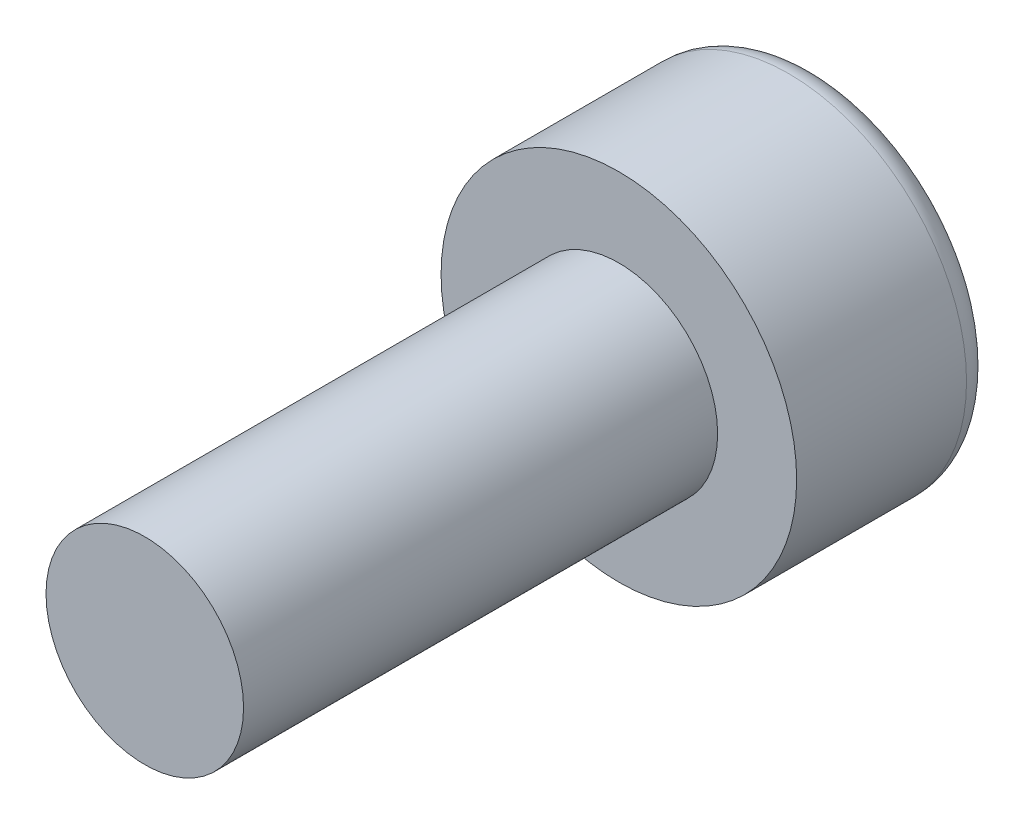
ISO-10303-21;
HEADER;
FILE_DESCRIPTION(('STEP AP214'),'2;1');
FILE_NAME('part.step','',(''),(''),'','','');
FILE_SCHEMA(('AUTOMOTIVE_DESIGN { 1 0 10303 214 1 1 1 1 }'));
ENDSEC;
DATA;
#1=APPLICATION_CONTEXT('core data for automotive mechanical design processes');
#2=APPLICATION_PROTOCOL_DEFINITION('international standard','automotive_design',2000,#1);
#3=PRODUCT_CONTEXT('',#1,'mechanical');
#4=PRODUCT('Part','Part','',(#3));
#5=PRODUCT_RELATED_PRODUCT_CATEGORY('part','',(#4));
#6=PRODUCT_DEFINITION_FORMATION('','',#4);
#7=PRODUCT_DEFINITION_CONTEXT('part definition',#1,'design');
#8=PRODUCT_DEFINITION('design','',#6,#7);
#9=PRODUCT_DEFINITION_SHAPE('','',#8);
#10=(LENGTH_UNIT() NAMED_UNIT(*) SI_UNIT(.MILLI.,.METRE.));
#11=(NAMED_UNIT(*) PLANE_ANGLE_UNIT() SI_UNIT($,.RADIAN.));
#12=(NAMED_UNIT(*) SI_UNIT($,.STERADIAN.) SOLID_ANGLE_UNIT());
#13=UNCERTAINTY_MEASURE_WITH_UNIT(LENGTH_MEASURE(1.E-05),#10,'distance_accuracy_value','');
#14=(GEOMETRIC_REPRESENTATION_CONTEXT(3) GLOBAL_UNCERTAINTY_ASSIGNED_CONTEXT((#13)) GLOBAL_UNIT_ASSIGNED_CONTEXT((#10,
#11,#12)) REPRESENTATION_CONTEXT('',''));
#15=CARTESIAN_POINT('',(0.,0.,0.));
#16=DIRECTION('',(0.,0.,1.));
#17=DIRECTION('',(1.,0.,0.));
#18=AXIS2_PLACEMENT_3D('',#15,#16,#17);
#19=CARTESIAN_POINT('',(0.,0.,6.));
#20=DIRECTION('',(0.,0.,-1.));
#21=DIRECTION('',(-1.,0.,0.));
#22=AXIS2_PLACEMENT_3D('',#19,#20,#21);
#23=CYLINDRICAL_SURFACE('',#22,1.25);
#24=CARTESIAN_POINT('',(0.,0.,6.));
#25=DIRECTION('',(0.,0.,1.));
#26=DIRECTION('',(1.,0.,0.));
#27=AXIS2_PLACEMENT_3D('',#24,#25,#26);
#28=CIRCLE('',#27,1.25);
#29=CARTESIAN_POINT('',(1.25,0.,6.));
#30=VERTEX_POINT('',#29);
#31=EDGE_CURVE('E145',#30,#30,#28,.T.);
#32=ORIENTED_EDGE('',*,*,#31,.F.);
#33=EDGE_LOOP('',(#32));
#34=FACE_BOUND('',#33,.T.);
#35=CARTESIAN_POINT('',(0.,0.,0.));
#36=DIRECTION('',(0.,0.,1.));
#37=DIRECTION('',(1.,0.,0.));
#38=AXIS2_PLACEMENT_3D('',#35,#36,#37);
#39=CIRCLE('',#38,1.25);
#40=CARTESIAN_POINT('',(1.25,0.,0.));
#41=VERTEX_POINT('',#40);
#42=EDGE_CURVE('E144',#41,#41,#39,.T.);
#43=ORIENTED_EDGE('',*,*,#42,.T.);
#44=EDGE_LOOP('',(#43));
#45=FACE_BOUND('',#44,.T.);
#46=ADVANCED_FACE('F34',(#34,#45),#23,.T.);
#47=CARTESIAN_POINT('',(0.,0.,6.));
#48=DIRECTION('',(0.,0.,1.));
#49=DIRECTION('',(1.,0.,0.));
#50=AXIS2_PLACEMENT_3D('',#47,#48,#49);
#51=PLANE('',#50);
#52=ORIENTED_EDGE('',*,*,#31,.T.);
#53=EDGE_LOOP('',(#52));
#54=FACE_BOUND('',#53,.T.);
#55=ADVANCED_FACE('F164',(#54),#51,.T.);
#56=CARTESIAN_POINT('',(0.,0.,-2.5));
#57=DIRECTION('',(0.,0.,1.));
#58=DIRECTION('',(1.,0.,0.));
#59=AXIS2_PLACEMENT_3D('',#56,#57,#58);
#60=CYLINDRICAL_SURFACE('',#59,2.25);
#61=CARTESIAN_POINT('',(0.,0.,-2.15));
#62=DIRECTION('',(0.,0.,-1.));
#63=DIRECTION('',(-1.,0.,0.));
#64=AXIS2_PLACEMENT_3D('',#61,#62,#63);
#65=CIRCLE('',#64,2.25);
#66=CARTESIAN_POINT('',(-2.25,0.,-2.15));
#67=VERTEX_POINT('',#66);
#68=EDGE_CURVE('E11',#67,#67,#65,.F.);
#69=ORIENTED_EDGE('',*,*,#68,.T.);
#70=EDGE_LOOP('',(#69));
#71=FACE_BOUND('',#70,.T.);
#72=CARTESIAN_POINT('',(0.,0.,0.));
#73=DIRECTION('',(0.,0.,-1.));
#74=DIRECTION('',(-1.,0.,0.));
#75=AXIS2_PLACEMENT_3D('',#72,#73,#74);
#76=CIRCLE('',#75,2.25);
#77=CARTESIAN_POINT('',(-2.25,0.,0.));
#78=VERTEX_POINT('',#77);
#79=EDGE_CURVE('E136',#78,#78,#76,.T.);
#80=ORIENTED_EDGE('',*,*,#79,.T.);
#81=EDGE_LOOP('',(#80));
#82=FACE_BOUND('',#81,.T.);
#83=ADVANCED_FACE('F169',(#71,#82),#60,.T.);
#84=CARTESIAN_POINT('',(0.,0.,-2.5));
#85=DIRECTION('',(0.,0.,-1.));
#86=DIRECTION('',(-1.,0.,0.));
#87=AXIS2_PLACEMENT_3D('',#84,#85,#86);
#88=PLANE('',#87);
#89=CARTESIAN_POINT('',(0.,0.,-2.5));
#90=DIRECTION('',(0.,0.,-1.));
#91=DIRECTION('',(-1.,0.,0.));
#92=AXIS2_PLACEMENT_3D('',#89,#90,#91);
#93=CIRCLE('',#92,1.9);
#94=CARTESIAN_POINT('',(-1.9,0.,-2.5));
#95=VERTEX_POINT('',#94);
#96=EDGE_CURVE('E42',#95,#95,#93,.T.);
#97=ORIENTED_EDGE('',*,*,#96,.T.);
#98=EDGE_LOOP('',(#97));
#99=FACE_BOUND('',#98,.T.);
#100=DIRECTION('',(-0.866025403784439,-0.5,0.));
#101=VECTOR('',#100,1.);
#102=CARTESIAN_POINT('',(1.,-0.577350269189626,-2.5));
#103=LINE('',#102,#101);
#104=CARTESIAN_POINT('',(1.,-0.577350269189626,-2.5));
#105=VERTEX_POINT('',#104);
#106=CARTESIAN_POINT('',(0.,-1.15470053837925,-2.5));
#107=VERTEX_POINT('',#106);
#108=EDGE_CURVE('E49',#105,#107,#103,.T.);
#109=ORIENTED_EDGE('',*,*,#108,.F.);
#110=DIRECTION('',(0.,-1.,0.));
#111=VECTOR('',#110,1.);
#112=CARTESIAN_POINT('',(1.,0.577350269189626,-2.5));
#113=LINE('',#112,#111);
#114=CARTESIAN_POINT('',(1.,0.577350269189626,-2.5));
#115=VERTEX_POINT('',#114);
#116=EDGE_CURVE('E132',#115,#105,#113,.T.);
#117=ORIENTED_EDGE('',*,*,#116,.F.);
#118=DIRECTION('',(0.866025403784439,-0.5,0.));
#119=VECTOR('',#118,1.);
#120=CARTESIAN_POINT('',(0.,1.15470053837925,-2.5));
#121=LINE('',#120,#119);
#122=CARTESIAN_POINT('',(0.,1.15470053837925,-2.5));
#123=VERTEX_POINT('',#122);
#124=EDGE_CURVE('E130',#123,#115,#121,.T.);
#125=ORIENTED_EDGE('',*,*,#124,.F.);
#126=DIRECTION('',(0.866025403784439,0.5,0.));
#127=VECTOR('',#126,1.);
#128=CARTESIAN_POINT('',(-1.,0.577350269189626,-2.5));
#129=LINE('',#128,#127);
#130=CARTESIAN_POINT('',(-1.,0.577350269189626,-2.5));
#131=VERTEX_POINT('',#130);
#132=EDGE_CURVE('E97',#131,#123,#129,.T.);
#133=ORIENTED_EDGE('',*,*,#132,.F.);
#134=DIRECTION('',(0.,1.,0.));
#135=VECTOR('',#134,1.);
#136=CARTESIAN_POINT('',(-1.,-0.577350269189626,-2.5));
#137=LINE('',#136,#135);
#138=CARTESIAN_POINT('',(-1.,-0.577350269189626,-2.5));
#139=VERTEX_POINT('',#138);
#140=EDGE_CURVE('E126',#139,#131,#137,.T.);
#141=ORIENTED_EDGE('',*,*,#140,.F.);
#142=DIRECTION('',(-0.866025403784438,0.5,0.));
#143=VECTOR('',#142,1.);
#144=CARTESIAN_POINT('',(0.,-1.15470053837925,-2.5));
#145=LINE('',#144,#143);
#146=EDGE_CURVE('E123',#107,#139,#145,.T.);
#147=ORIENTED_EDGE('',*,*,#146,.F.);
#148=EDGE_LOOP('',(#109,#117,#125,#133,#141,#147));
#149=FACE_BOUND('',#148,.T.);
#150=ADVANCED_FACE('F152',(#99,#149),#88,.T.);
#151=CARTESIAN_POINT('',(0.,0.,0.));
#152=DIRECTION('',(0.,0.,-1.));
#153=DIRECTION('',(-1.,0.,0.));
#154=AXIS2_PLACEMENT_3D('',#151,#152,#153);
#155=PLANE('',#154);
#156=ORIENTED_EDGE('',*,*,#42,.F.);
#157=EDGE_LOOP('',(#156));
#158=FACE_BOUND('',#157,.T.);
#159=ORIENTED_EDGE('',*,*,#79,.F.);
#160=EDGE_LOOP('',(#159));
#161=FACE_BOUND('',#160,.T.);
#162=ADVANCED_FACE('F178',(#158,#161),#155,.F.);
#163=CARTESIAN_POINT('',(1.,-0.577350269189626,-1.));
#164=DIRECTION('',(0.5,-0.866025403784438,0.));
#165=DIRECTION('',(0.866025403784439,0.5,0.));
#166=AXIS2_PLACEMENT_3D('',#163,#164,#165);
#167=PLANE('',#166);
#168=ORIENTED_EDGE('',*,*,#108,.T.);
#169=DIRECTION('',(0.,0.,-1.));
#170=VECTOR('',#169,1.);
#171=CARTESIAN_POINT('',(0.,-1.15470053837925,-1.));
#172=LINE('',#171,#170);
#173=CARTESIAN_POINT('',(0.,-1.15470053837925,-1.));
#174=VERTEX_POINT('',#173);
#175=EDGE_CURVE('E79',#174,#107,#172,.T.);
#176=ORIENTED_EDGE('',*,*,#175,.F.);
#177=DIRECTION('',(-0.866025403784439,-0.5,0.));
#178=VECTOR('',#177,1.);
#179=CARTESIAN_POINT('',(1.,-0.577350269189626,-1.));
#180=LINE('',#179,#178);
#181=CARTESIAN_POINT('',(1.,-0.577350269189626,-1.));
#182=VERTEX_POINT('',#181);
#183=EDGE_CURVE('E134',#182,#174,#180,.T.);
#184=ORIENTED_EDGE('',*,*,#183,.F.);
#185=DIRECTION('',(0.,0.,-1.));
#186=VECTOR('',#185,1.);
#187=CARTESIAN_POINT('',(1.,-0.577350269189626,-1.));
#188=LINE('',#187,#186);
#189=EDGE_CURVE('E57',#182,#105,#188,.T.);
#190=ORIENTED_EDGE('',*,*,#189,.T.);
#191=EDGE_LOOP('',(#168,#176,#184,#190));
#192=FACE_BOUND('',#191,.T.);
#193=ADVANCED_FACE('F181',(#192),#167,.F.);
#194=CARTESIAN_POINT('',(1.,0.577350269189626,-1.));
#195=DIRECTION('',(1.,0.,0.));
#196=DIRECTION('',(0.,1.,0.));
#197=AXIS2_PLACEMENT_3D('',#194,#195,#196);
#198=PLANE('',#197);
#199=ORIENTED_EDGE('',*,*,#116,.T.);
#200=ORIENTED_EDGE('',*,*,#189,.F.);
#201=DIRECTION('',(0.,-1.,0.));
#202=VECTOR('',#201,1.);
#203=CARTESIAN_POINT('',(1.,0.577350269189626,-1.));
#204=LINE('',#203,#202);
#205=CARTESIAN_POINT('',(1.,0.577350269189626,-1.));
#206=VERTEX_POINT('',#205);
#207=EDGE_CURVE('E109',#206,#182,#204,.T.);
#208=ORIENTED_EDGE('',*,*,#207,.F.);
#209=DIRECTION('',(0.,0.,-1.));
#210=VECTOR('',#209,1.);
#211=CARTESIAN_POINT('',(1.,0.577350269189626,-1.));
#212=LINE('',#211,#210);
#213=EDGE_CURVE('E101',#206,#115,#212,.T.);
#214=ORIENTED_EDGE('',*,*,#213,.T.);
#215=EDGE_LOOP('',(#199,#200,#208,#214));
#216=FACE_BOUND('',#215,.T.);
#217=ADVANCED_FACE('F187',(#216),#198,.F.);
#218=CARTESIAN_POINT('',(0.,1.15470053837925,-1.));
#219=DIRECTION('',(0.5,0.866025403784439,0.));
#220=DIRECTION('',(-0.866025403784439,0.5,0.));
#221=AXIS2_PLACEMENT_3D('',#218,#219,#220);
#222=PLANE('',#221);
#223=ORIENTED_EDGE('',*,*,#124,.T.);
#224=ORIENTED_EDGE('',*,*,#213,.F.);
#225=DIRECTION('',(0.866025403784439,-0.5,0.));
#226=VECTOR('',#225,1.);
#227=CARTESIAN_POINT('',(0.,1.15470053837925,-1.));
#228=LINE('',#227,#226);
#229=CARTESIAN_POINT('',(0.,1.15470053837925,-1.));
#230=VERTEX_POINT('',#229);
#231=EDGE_CURVE('E105',#230,#206,#228,.T.);
#232=ORIENTED_EDGE('',*,*,#231,.F.);
#233=DIRECTION('',(0.,0.,-1.));
#234=VECTOR('',#233,1.);
#235=CARTESIAN_POINT('',(0.,1.15470053837925,-1.));
#236=LINE('',#235,#234);
#237=EDGE_CURVE('E90',#230,#123,#236,.T.);
#238=ORIENTED_EDGE('',*,*,#237,.T.);
#239=EDGE_LOOP('',(#223,#224,#232,#238));
#240=FACE_BOUND('',#239,.T.);
#241=ADVANCED_FACE('F106',(#240),#222,.F.);
#242=CARTESIAN_POINT('',(-1.,0.577350269189626,-1.));
#243=DIRECTION('',(-0.5,0.866025403784439,0.));
#244=DIRECTION('',(-0.866025403784439,-0.5,0.));
#245=AXIS2_PLACEMENT_3D('',#242,#243,#244);
#246=PLANE('',#245);
#247=ORIENTED_EDGE('',*,*,#132,.T.);
#248=ORIENTED_EDGE('',*,*,#237,.F.);
#249=DIRECTION('',(0.866025403784439,0.5,0.));
#250=VECTOR('',#249,1.);
#251=CARTESIAN_POINT('',(-1.,0.577350269189626,-1.));
#252=LINE('',#251,#250);
#253=CARTESIAN_POINT('',(-1.,0.577350269189626,-1.));
#254=VERTEX_POINT('',#253);
#255=EDGE_CURVE('E94',#254,#230,#252,.T.);
#256=ORIENTED_EDGE('',*,*,#255,.F.);
#257=DIRECTION('',(0.,0.,-1.));
#258=VECTOR('',#257,1.);
#259=CARTESIAN_POINT('',(-1.,0.577350269189626,-1.));
#260=LINE('',#259,#258);
#261=EDGE_CURVE('E102',#254,#131,#260,.T.);
#262=ORIENTED_EDGE('',*,*,#261,.T.);
#263=EDGE_LOOP('',(#247,#248,#256,#262));
#264=FACE_BOUND('',#263,.T.);
#265=ADVANCED_FACE('F92',(#264),#246,.F.);
#266=CARTESIAN_POINT('',(-1.,-0.577350269189626,-1.));
#267=DIRECTION('',(-1.,0.,0.));
#268=DIRECTION('',(0.,0.,1.));
#269=AXIS2_PLACEMENT_3D('',#266,#267,#268);
#270=PLANE('',#269);
#271=ORIENTED_EDGE('',*,*,#140,.T.);
#272=ORIENTED_EDGE('',*,*,#261,.F.);
#273=DIRECTION('',(0.,1.,0.));
#274=VECTOR('',#273,1.);
#275=CARTESIAN_POINT('',(-1.,-0.577350269189626,-1.));
#276=LINE('',#275,#274);
#277=CARTESIAN_POINT('',(-1.,-0.577350269189626,-1.));
#278=VERTEX_POINT('',#277);
#279=EDGE_CURVE('E115',#278,#254,#276,.T.);
#280=ORIENTED_EDGE('',*,*,#279,.F.);
#281=DIRECTION('',(0.,0.,-1.));
#282=VECTOR('',#281,1.);
#283=CARTESIAN_POINT('',(-1.,-0.577350269189626,-1.));
#284=LINE('',#283,#282);
#285=EDGE_CURVE('E139',#278,#139,#284,.T.);
#286=ORIENTED_EDGE('',*,*,#285,.T.);
#287=EDGE_LOOP('',(#271,#272,#280,#286));
#288=FACE_BOUND('',#287,.T.);
#289=ADVANCED_FACE('F190',(#288),#270,.F.);
#290=CARTESIAN_POINT('',(0.,-1.15470053837925,-1.));
#291=DIRECTION('',(-0.5,-0.866025403784439,0.));
#292=DIRECTION('',(0.866025403784439,-0.5,0.));
#293=AXIS2_PLACEMENT_3D('',#290,#291,#292);
#294=PLANE('',#293);
#295=ORIENTED_EDGE('',*,*,#146,.T.);
#296=ORIENTED_EDGE('',*,*,#285,.F.);
#297=DIRECTION('',(-0.866025403784438,0.5,0.));
#298=VECTOR('',#297,1.);
#299=CARTESIAN_POINT('',(0.,-1.15470053837925,-1.));
#300=LINE('',#299,#298);
#301=EDGE_CURVE('E117',#174,#278,#300,.T.);
#302=ORIENTED_EDGE('',*,*,#301,.F.);
#303=ORIENTED_EDGE('',*,*,#175,.T.);
#304=EDGE_LOOP('',(#295,#296,#302,#303));
#305=FACE_BOUND('',#304,.T.);
#306=ADVANCED_FACE('F160',(#305),#294,.F.);
#307=CARTESIAN_POINT('',(0.,0.,-1.));
#308=DIRECTION('',(0.,0.,-1.));
#309=DIRECTION('',(-1.,0.,0.));
#310=AXIS2_PLACEMENT_3D('',#307,#308,#309);
#311=PLANE('',#310);
#312=ORIENTED_EDGE('',*,*,#183,.T.);
#313=ORIENTED_EDGE('',*,*,#301,.T.);
#314=ORIENTED_EDGE('',*,*,#279,.T.);
#315=ORIENTED_EDGE('',*,*,#255,.T.);
#316=ORIENTED_EDGE('',*,*,#231,.T.);
#317=ORIENTED_EDGE('',*,*,#207,.T.);
#318=EDGE_LOOP('',(#312,#313,#314,#315,#316,#317));
#319=FACE_BOUND('',#318,.T.);
#320=ADVANCED_FACE('F112',(#319),#311,.T.);
#321=CARTESIAN_POINT('',(0.,0.,-2.15));
#322=DIRECTION('',(0.,0.,-1.));
#323=DIRECTION('',(-1.,0.,0.));
#324=AXIS2_PLACEMENT_3D('',#321,#322,#323);
#325=TOROIDAL_SURFACE('',#324,1.9,0.35);
#326=ORIENTED_EDGE('',*,*,#68,.F.);
#327=EDGE_LOOP('',(#326));
#328=FACE_BOUND('',#327,.T.);
#329=ORIENTED_EDGE('',*,*,#96,.F.);
#330=EDGE_LOOP('',(#329));
#331=FACE_BOUND('',#330,.T.);
#332=ADVANCED_FACE('F36',(#328,#331),#325,.T.);
#333=CLOSED_SHELL('',(#46,#55,#83,#150,#162,#193,#217,#241,#265,#289,#306,#320,#332));
#334=MANIFOLD_SOLID_BREP('B2',#333);
#335=ADVANCED_BREP_SHAPE_REPRESENTATION('',(#18,#334),#14);
#336=SHAPE_DEFINITION_REPRESENTATION(#9,#335);
ENDSEC;
END-ISO-10303-21;
